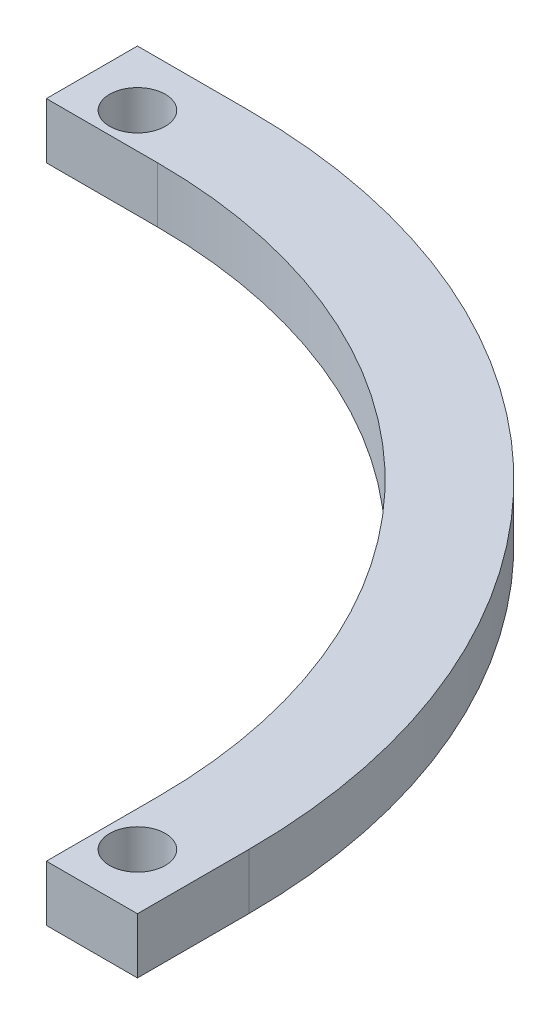
ISO-10303-21;
HEADER;
FILE_DESCRIPTION(('STEP AP214'),'2;1');
FILE_NAME('part.step','',(''),(''),'','','');
FILE_SCHEMA(('AUTOMOTIVE_DESIGN { 1 0 10303 214 1 1 1 1 }'));
ENDSEC;
DATA;
#1=APPLICATION_CONTEXT('core data for automotive mechanical design processes');
#2=APPLICATION_PROTOCOL_DEFINITION('international standard','automotive_design',2000,#1);
#3=PRODUCT_CONTEXT('',#1,'mechanical');
#4=PRODUCT('Part','Part','',(#3));
#5=PRODUCT_RELATED_PRODUCT_CATEGORY('part','',(#4));
#6=PRODUCT_DEFINITION_FORMATION('','',#4);
#7=PRODUCT_DEFINITION_CONTEXT('part definition',#1,'design');
#8=PRODUCT_DEFINITION('design','',#6,#7);
#9=PRODUCT_DEFINITION_SHAPE('','',#8);
#10=(LENGTH_UNIT() NAMED_UNIT(*) SI_UNIT(.MILLI.,.METRE.));
#11=(NAMED_UNIT(*) PLANE_ANGLE_UNIT() SI_UNIT($,.RADIAN.));
#12=(NAMED_UNIT(*) SI_UNIT($,.STERADIAN.) SOLID_ANGLE_UNIT());
#13=UNCERTAINTY_MEASURE_WITH_UNIT(LENGTH_MEASURE(1.E-05),#10,'distance_accuracy_value','');
#14=(GEOMETRIC_REPRESENTATION_CONTEXT(3) GLOBAL_UNCERTAINTY_ASSIGNED_CONTEXT((#13)) GLOBAL_UNIT_ASSIGNED_CONTEXT((#10,
#11,#12)) REPRESENTATION_CONTEXT('',''));
#15=CARTESIAN_POINT('',(0.,0.,0.));
#16=DIRECTION('',(0.,0.,1.));
#17=DIRECTION('',(1.,0.,0.));
#18=AXIS2_PLACEMENT_3D('',#15,#16,#17);
#19=CARTESIAN_POINT('',(0.,-0.00999999999999959,-49.32));
#20=DIRECTION('',(0.,0.,-1.));
#21=DIRECTION('',(-1.,0.,0.));
#22=AXIS2_PLACEMENT_3D('',#19,#20,#21);
#23=PLANE('',#22);
#24=DIRECTION('',(0.,1.,0.));
#25=VECTOR('',#24,1.);
#26=CARTESIAN_POINT('',(0.,-0.00999999999999959,-49.32));
#27=LINE('',#26,#25);
#28=CARTESIAN_POINT('',(0.,0.,-49.32));
#29=VERTEX_POINT('',#28);
#30=CARTESIAN_POINT('',(0.,5.,-49.32));
#31=VERTEX_POINT('',#30);
#32=EDGE_CURVE('E11',#29,#31,#27,.T.);
#33=ORIENTED_EDGE('',*,*,#32,.T.);
#34=DIRECTION('',(-1.,0.,0.));
#35=VECTOR('',#34,1.);
#36=CARTESIAN_POINT('',(0.,5.,-49.32));
#37=LINE('',#36,#35);
#38=CARTESIAN_POINT('',(-10.0000000000002,5.,-49.32));
#39=VERTEX_POINT('',#38);
#40=EDGE_CURVE('E155',#31,#39,#37,.T.);
#41=ORIENTED_EDGE('',*,*,#40,.T.);
#42=DIRECTION('',(0.,1.,0.));
#43=VECTOR('',#42,1.);
#44=CARTESIAN_POINT('',(-10.0000000000002,5.,-49.32));
#45=LINE('',#44,#43);
#46=CARTESIAN_POINT('',(-10.0000000000002,0.,-49.32));
#47=VERTEX_POINT('',#46);
#48=EDGE_CURVE('E117',#47,#39,#45,.T.);
#49=ORIENTED_EDGE('',*,*,#48,.F.);
#50=DIRECTION('',(-1.,0.,0.));
#51=VECTOR('',#50,1.);
#52=CARTESIAN_POINT('',(0.,0.,-49.32));
#53=LINE('',#52,#51);
#54=EDGE_CURVE('E48',#29,#47,#53,.T.);
#55=ORIENTED_EDGE('',*,*,#54,.F.);
#56=EDGE_LOOP('',(#33,#41,#49,#55));
#57=FACE_BOUND('',#56,.T.);
#58=ADVANCED_FACE('F32',(#57),#23,.F.);
#59=CARTESIAN_POINT('',(49.32,-0.00999999999999959,0.));
#60=DIRECTION('',(1.,0.,0.));
#61=DIRECTION('',(0.,0.,-1.));
#62=AXIS2_PLACEMENT_3D('',#59,#60,#61);
#63=PLANE('',#62);
#64=DIRECTION('',(0.,-1.,0.));
#65=VECTOR('',#64,1.);
#66=CARTESIAN_POINT('',(49.32,5.,9.99999999999999));
#67=LINE('',#66,#65);
#68=CARTESIAN_POINT('',(49.32,5.,9.99999999999999));
#69=VERTEX_POINT('',#68);
#70=CARTESIAN_POINT('',(49.32,0.,9.99999999999999));
#71=VERTEX_POINT('',#70);
#72=EDGE_CURVE('E151',#69,#71,#67,.T.);
#73=ORIENTED_EDGE('',*,*,#72,.F.);
#74=DIRECTION('',(0.,0.,-1.));
#75=VECTOR('',#74,1.);
#76=CARTESIAN_POINT('',(49.32,5.,0.));
#77=LINE('',#76,#75);
#78=CARTESIAN_POINT('',(49.32,5.,0.));
#79=VERTEX_POINT('',#78);
#80=EDGE_CURVE('E105',#69,#79,#77,.T.);
#81=ORIENTED_EDGE('',*,*,#80,.T.);
#82=DIRECTION('',(0.,1.,0.));
#83=VECTOR('',#82,1.);
#84=CARTESIAN_POINT('',(49.32,-0.00999999999999959,0.));
#85=LINE('',#84,#83);
#86=CARTESIAN_POINT('',(49.32,0.,0.));
#87=VERTEX_POINT('',#86);
#88=EDGE_CURVE('E41',#87,#79,#85,.T.);
#89=ORIENTED_EDGE('',*,*,#88,.F.);
#90=DIRECTION('',(0.,0.,-1.));
#91=VECTOR('',#90,1.);
#92=CARTESIAN_POINT('',(49.32,0.,0.));
#93=LINE('',#92,#91);
#94=EDGE_CURVE('E36',#71,#87,#93,.T.);
#95=ORIENTED_EDGE('',*,*,#94,.F.);
#96=EDGE_LOOP('',(#73,#81,#89,#95));
#97=FACE_BOUND('',#96,.T.);
#98=ADVANCED_FACE('F34',(#97),#63,.F.);
#99=CARTESIAN_POINT('',(0.,-0.00999999999999959,0.));
#100=DIRECTION('',(0.,1.,0.));
#101=DIRECTION('',(0.,0.,1.));
#102=AXIS2_PLACEMENT_3D('',#99,#100,#101);
#103=CYLINDRICAL_SURFACE('',#102,49.32);
#104=ORIENTED_EDGE('',*,*,#88,.T.);
#105=CARTESIAN_POINT('',(0.,5.,0.));
#106=DIRECTION('',(0.,1.,0.));
#107=DIRECTION('',(0.,0.,1.));
#108=AXIS2_PLACEMENT_3D('',#105,#106,#107);
#109=CIRCLE('',#108,49.32);
#110=EDGE_CURVE('E158',#79,#31,#109,.T.);
#111=ORIENTED_EDGE('',*,*,#110,.T.);
#112=ORIENTED_EDGE('',*,*,#32,.F.);
#113=CARTESIAN_POINT('',(0.,0.,0.));
#114=DIRECTION('',(0.,1.,0.));
#115=DIRECTION('',(0.,0.,1.));
#116=AXIS2_PLACEMENT_3D('',#113,#114,#115);
#117=CIRCLE('',#116,49.32);
#118=EDGE_CURVE('E153',#87,#29,#117,.T.);
#119=ORIENTED_EDGE('',*,*,#118,.F.);
#120=EDGE_LOOP('',(#104,#111,#112,#119));
#121=FACE_BOUND('',#120,.T.);
#122=ADVANCED_FACE('F180',(#121),#103,.F.);
#123=CARTESIAN_POINT('',(-5.00000000000019,5.,-52.5));
#124=DIRECTION('',(0.,-1.,0.));
#125=DIRECTION('',(0.,0.,-1.));
#126=AXIS2_PLACEMENT_3D('',#123,#124,#125);
#127=CYLINDRICAL_SURFACE('',#126,2.5);
#128=CARTESIAN_POINT('',(-5.00000000000019,5.,-52.5));
#129=DIRECTION('',(0.,1.,0.));
#130=DIRECTION('',(0.,0.,-1.));
#131=AXIS2_PLACEMENT_3D('',#128,#129,#130);
#132=CIRCLE('',#131,2.5);
#133=CARTESIAN_POINT('',(-5.00000000000019,5.,-55.));
#134=VERTEX_POINT('',#133);
#135=EDGE_CURVE('E221',#134,#134,#132,.T.);
#136=ORIENTED_EDGE('',*,*,#135,.T.);
#137=EDGE_LOOP('',(#136));
#138=FACE_BOUND('',#137,.T.);
#139=CARTESIAN_POINT('',(-5.00000000000019,0.,-52.5));
#140=DIRECTION('',(0.,1.,0.));
#141=DIRECTION('',(0.,0.,-1.));
#142=AXIS2_PLACEMENT_3D('',#139,#140,#141);
#143=CIRCLE('',#142,2.5);
#144=CARTESIAN_POINT('',(-5.00000000000019,0.,-55.));
#145=VERTEX_POINT('',#144);
#146=EDGE_CURVE('E224',#145,#145,#143,.T.);
#147=ORIENTED_EDGE('',*,*,#146,.F.);
#148=EDGE_LOOP('',(#147));
#149=FACE_BOUND('',#148,.T.);
#150=ADVANCED_FACE('F188',(#138,#149),#127,.F.);
#151=CARTESIAN_POINT('',(52.5,5.,5.));
#152=DIRECTION('',(0.,-1.,0.));
#153=DIRECTION('',(0.,0.,-1.));
#154=AXIS2_PLACEMENT_3D('',#151,#152,#153);
#155=CYLINDRICAL_SURFACE('',#154,2.5);
#156=CARTESIAN_POINT('',(52.5,5.,5.));
#157=DIRECTION('',(0.,1.,0.));
#158=DIRECTION('',(0.,0.,1.));
#159=AXIS2_PLACEMENT_3D('',#156,#157,#158);
#160=CIRCLE('',#159,2.5);
#161=CARTESIAN_POINT('',(52.5,5.,7.5));
#162=VERTEX_POINT('',#161);
#163=EDGE_CURVE('E136',#162,#162,#160,.T.);
#164=ORIENTED_EDGE('',*,*,#163,.T.);
#165=EDGE_LOOP('',(#164));
#166=FACE_BOUND('',#165,.T.);
#167=CARTESIAN_POINT('',(52.5,0.,5.));
#168=DIRECTION('',(0.,1.,0.));
#169=DIRECTION('',(0.,0.,1.));
#170=AXIS2_PLACEMENT_3D('',#167,#168,#169);
#171=CIRCLE('',#170,2.5);
#172=CARTESIAN_POINT('',(52.5,0.,7.5));
#173=VERTEX_POINT('',#172);
#174=EDGE_CURVE('E227',#173,#173,#171,.T.);
#175=ORIENTED_EDGE('',*,*,#174,.F.);
#176=EDGE_LOOP('',(#175));
#177=FACE_BOUND('',#176,.T.);
#178=ADVANCED_FACE('F200',(#166,#177),#155,.F.);
#179=CARTESIAN_POINT('',(0.,5.,0.));
#180=DIRECTION('',(0.,-1.,0.));
#181=DIRECTION('',(0.,0.,-1.));
#182=AXIS2_PLACEMENT_3D('',#179,#180,#181);
#183=CYLINDRICAL_SURFACE('',#182,57.5);
#184=CARTESIAN_POINT('',(0.,0.,0.));
#185=DIRECTION('',(0.,1.,0.));
#186=DIRECTION('',(0.,0.,1.));
#187=AXIS2_PLACEMENT_3D('',#184,#185,#186);
#188=CIRCLE('',#187,57.5);
#189=CARTESIAN_POINT('',(57.5,0.,0.));
#190=VERTEX_POINT('',#189);
#191=CARTESIAN_POINT('',(0.,0.,-57.5));
#192=VERTEX_POINT('',#191);
#193=EDGE_CURVE('E138',#190,#192,#188,.T.);
#194=ORIENTED_EDGE('',*,*,#193,.T.);
#195=DIRECTION('',(0.,-1.,0.));
#196=VECTOR('',#195,1.);
#197=CARTESIAN_POINT('',(0.,5.,-57.5));
#198=LINE('',#197,#196);
#199=CARTESIAN_POINT('',(0.,5.,-57.5));
#200=VERTEX_POINT('',#199);
#201=EDGE_CURVE('E146',#200,#192,#198,.T.);
#202=ORIENTED_EDGE('',*,*,#201,.F.);
#203=CARTESIAN_POINT('',(0.,5.,0.));
#204=DIRECTION('',(0.,1.,0.));
#205=DIRECTION('',(0.,0.,1.));
#206=AXIS2_PLACEMENT_3D('',#203,#204,#205);
#207=CIRCLE('',#206,57.5);
#208=CARTESIAN_POINT('',(57.5,5.,0.));
#209=VERTEX_POINT('',#208);
#210=EDGE_CURVE('E123',#209,#200,#207,.T.);
#211=ORIENTED_EDGE('',*,*,#210,.F.);
#212=DIRECTION('',(0.,-1.,0.));
#213=VECTOR('',#212,1.);
#214=CARTESIAN_POINT('',(57.5,5.,0.));
#215=LINE('',#214,#213);
#216=EDGE_CURVE('E118',#209,#190,#215,.T.);
#217=ORIENTED_EDGE('',*,*,#216,.T.);
#218=EDGE_LOOP('',(#194,#202,#211,#217));
#219=FACE_BOUND('',#218,.T.);
#220=ADVANCED_FACE('F178',(#219),#183,.T.);
#221=CARTESIAN_POINT('',(57.5,5.,9.99999999999999));
#222=DIRECTION('',(-1.,0.,0.));
#223=DIRECTION('',(0.,0.,1.));
#224=AXIS2_PLACEMENT_3D('',#221,#222,#223);
#225=PLANE('',#224);
#226=DIRECTION('',(0.,0.,-1.));
#227=VECTOR('',#226,1.);
#228=CARTESIAN_POINT('',(57.5,0.,9.99999999999999));
#229=LINE('',#228,#227);
#230=CARTESIAN_POINT('',(57.5,0.,9.99999999999999));
#231=VERTEX_POINT('',#230);
#232=EDGE_CURVE('E135',#231,#190,#229,.T.);
#233=ORIENTED_EDGE('',*,*,#232,.T.);
#234=ORIENTED_EDGE('',*,*,#216,.F.);
#235=DIRECTION('',(0.,0.,-1.));
#236=VECTOR('',#235,1.);
#237=CARTESIAN_POINT('',(57.5,5.,9.99999999999999));
#238=LINE('',#237,#236);
#239=CARTESIAN_POINT('',(57.5,5.,9.99999999999999));
#240=VERTEX_POINT('',#239);
#241=EDGE_CURVE('E102',#240,#209,#238,.T.);
#242=ORIENTED_EDGE('',*,*,#241,.F.);
#243=DIRECTION('',(0.,-1.,0.));
#244=VECTOR('',#243,1.);
#245=CARTESIAN_POINT('',(57.5,5.,9.99999999999999));
#246=LINE('',#245,#244);
#247=EDGE_CURVE('E112',#240,#231,#246,.T.);
#248=ORIENTED_EDGE('',*,*,#247,.T.);
#249=EDGE_LOOP('',(#233,#234,#242,#248));
#250=FACE_BOUND('',#249,.T.);
#251=ADVANCED_FACE('F120',(#250),#225,.F.);
#252=CARTESIAN_POINT('',(-10.0000000000002,5.,-57.5));
#253=DIRECTION('',(0.,0.,1.));
#254=DIRECTION('',(1.,0.,0.));
#255=AXIS2_PLACEMENT_3D('',#252,#253,#254);
#256=PLANE('',#255);
#257=DIRECTION('',(-1.,0.,0.));
#258=VECTOR('',#257,1.);
#259=CARTESIAN_POINT('',(-10.0000000000002,0.,-57.5));
#260=LINE('',#259,#258);
#261=CARTESIAN_POINT('',(-10.0000000000002,0.,-57.5));
#262=VERTEX_POINT('',#261);
#263=EDGE_CURVE('E140',#192,#262,#260,.T.);
#264=ORIENTED_EDGE('',*,*,#263,.T.);
#265=DIRECTION('',(0.,-1.,0.));
#266=VECTOR('',#265,1.);
#267=CARTESIAN_POINT('',(-10.0000000000002,5.,-57.5));
#268=LINE('',#267,#266);
#269=CARTESIAN_POINT('',(-10.0000000000002,5.,-57.5));
#270=VERTEX_POINT('',#269);
#271=EDGE_CURVE('E133',#270,#262,#268,.T.);
#272=ORIENTED_EDGE('',*,*,#271,.F.);
#273=DIRECTION('',(-1.,0.,0.));
#274=VECTOR('',#273,1.);
#275=CARTESIAN_POINT('',(-10.0000000000002,5.,-57.5));
#276=LINE('',#275,#274);
#277=EDGE_CURVE('E125',#200,#270,#276,.T.);
#278=ORIENTED_EDGE('',*,*,#277,.F.);
#279=ORIENTED_EDGE('',*,*,#201,.T.);
#280=EDGE_LOOP('',(#264,#272,#278,#279));
#281=FACE_BOUND('',#280,.T.);
#282=ADVANCED_FACE('F174',(#281),#256,.F.);
#283=CARTESIAN_POINT('',(0.,5.,0.));
#284=DIRECTION('',(0.,1.,0.));
#285=DIRECTION('',(0.,0.,1.));
#286=AXIS2_PLACEMENT_3D('',#283,#284,#285);
#287=PLANE('',#286);
#288=ORIENTED_EDGE('',*,*,#80,.F.);
#289=DIRECTION('',(1.,0.,0.));
#290=VECTOR('',#289,1.);
#291=CARTESIAN_POINT('',(47.5,5.,9.99999999999999));
#292=LINE('',#291,#290);
#293=EDGE_CURVE('E97',#69,#240,#292,.T.);
#294=ORIENTED_EDGE('',*,*,#293,.T.);
#295=ORIENTED_EDGE('',*,*,#241,.T.);
#296=ORIENTED_EDGE('',*,*,#210,.T.);
#297=ORIENTED_EDGE('',*,*,#277,.T.);
#298=DIRECTION('',(0.,0.,1.));
#299=VECTOR('',#298,1.);
#300=CARTESIAN_POINT('',(-10.0000000000002,5.,-47.5));
#301=LINE('',#300,#299);
#302=EDGE_CURVE('E130',#270,#39,#301,.T.);
#303=ORIENTED_EDGE('',*,*,#302,.T.);
#304=ORIENTED_EDGE('',*,*,#40,.F.);
#305=ORIENTED_EDGE('',*,*,#110,.F.);
#306=EDGE_LOOP('',(#288,#294,#295,#296,#297,#303,#304,#305));
#307=FACE_BOUND('',#306,.T.);
#308=ORIENTED_EDGE('',*,*,#163,.F.);
#309=EDGE_LOOP('',(#308));
#310=FACE_BOUND('',#309,.T.);
#311=ORIENTED_EDGE('',*,*,#135,.F.);
#312=EDGE_LOOP('',(#311));
#313=FACE_BOUND('',#312,.T.);
#314=ADVANCED_FACE('F99',(#307,#310,#313),#287,.T.);
#315=CARTESIAN_POINT('',(0.,0.,0.));
#316=DIRECTION('',(0.,1.,0.));
#317=DIRECTION('',(0.,0.,1.));
#318=AXIS2_PLACEMENT_3D('',#315,#316,#317);
#319=PLANE('',#318);
#320=DIRECTION('',(1.,0.,0.));
#321=VECTOR('',#320,1.);
#322=CARTESIAN_POINT('',(47.5,0.,9.99999999999999));
#323=LINE('',#322,#321);
#324=EDGE_CURVE('E114',#71,#231,#323,.T.);
#325=ORIENTED_EDGE('',*,*,#324,.F.);
#326=ORIENTED_EDGE('',*,*,#94,.T.);
#327=ORIENTED_EDGE('',*,*,#118,.T.);
#328=ORIENTED_EDGE('',*,*,#54,.T.);
#329=DIRECTION('',(0.,0.,1.));
#330=VECTOR('',#329,1.);
#331=CARTESIAN_POINT('',(-10.0000000000002,0.,-47.5));
#332=LINE('',#331,#330);
#333=EDGE_CURVE('E109',#262,#47,#332,.T.);
#334=ORIENTED_EDGE('',*,*,#333,.F.);
#335=ORIENTED_EDGE('',*,*,#263,.F.);
#336=ORIENTED_EDGE('',*,*,#193,.F.);
#337=ORIENTED_EDGE('',*,*,#232,.F.);
#338=EDGE_LOOP('',(#325,#326,#327,#328,#334,#335,#336,#337));
#339=FACE_BOUND('',#338,.T.);
#340=ORIENTED_EDGE('',*,*,#174,.T.);
#341=EDGE_LOOP('',(#340));
#342=FACE_BOUND('',#341,.T.);
#343=ORIENTED_EDGE('',*,*,#146,.T.);
#344=EDGE_LOOP('',(#343));
#345=FACE_BOUND('',#344,.T.);
#346=ADVANCED_FACE('F164',(#339,#342,#345),#319,.F.);
#347=CARTESIAN_POINT('',(-10.0000000000002,5.,-47.5));
#348=DIRECTION('',(1.,0.,0.));
#349=DIRECTION('',(0.,0.,-1.));
#350=AXIS2_PLACEMENT_3D('',#347,#348,#349);
#351=PLANE('',#350);
#352=ORIENTED_EDGE('',*,*,#333,.T.);
#353=ORIENTED_EDGE('',*,*,#48,.T.);
#354=ORIENTED_EDGE('',*,*,#302,.F.);
#355=ORIENTED_EDGE('',*,*,#271,.T.);
#356=EDGE_LOOP('',(#352,#353,#354,#355));
#357=FACE_BOUND('',#356,.T.);
#358=ADVANCED_FACE('F170',(#357),#351,.F.);
#359=CARTESIAN_POINT('',(47.5,5.,9.99999999999999));
#360=DIRECTION('',(0.,0.,-1.));
#361=DIRECTION('',(-1.,0.,0.));
#362=AXIS2_PLACEMENT_3D('',#359,#360,#361);
#363=PLANE('',#362);
#364=ORIENTED_EDGE('',*,*,#293,.F.);
#365=ORIENTED_EDGE('',*,*,#72,.T.);
#366=ORIENTED_EDGE('',*,*,#324,.T.);
#367=ORIENTED_EDGE('',*,*,#247,.F.);
#368=EDGE_LOOP('',(#364,#365,#366,#367));
#369=FACE_BOUND('',#368,.T.);
#370=ADVANCED_FACE('F113',(#369),#363,.F.);
#371=CLOSED_SHELL('',(#58,#98,#122,#150,#178,#220,#251,#282,#314,#346,#358,#370));
#372=MANIFOLD_SOLID_BREP('B2',#371);
#373=ADVANCED_BREP_SHAPE_REPRESENTATION('',(#18,#372),#14);
#374=SHAPE_DEFINITION_REPRESENTATION(#9,#373);
ENDSEC;
END-ISO-10303-21;
